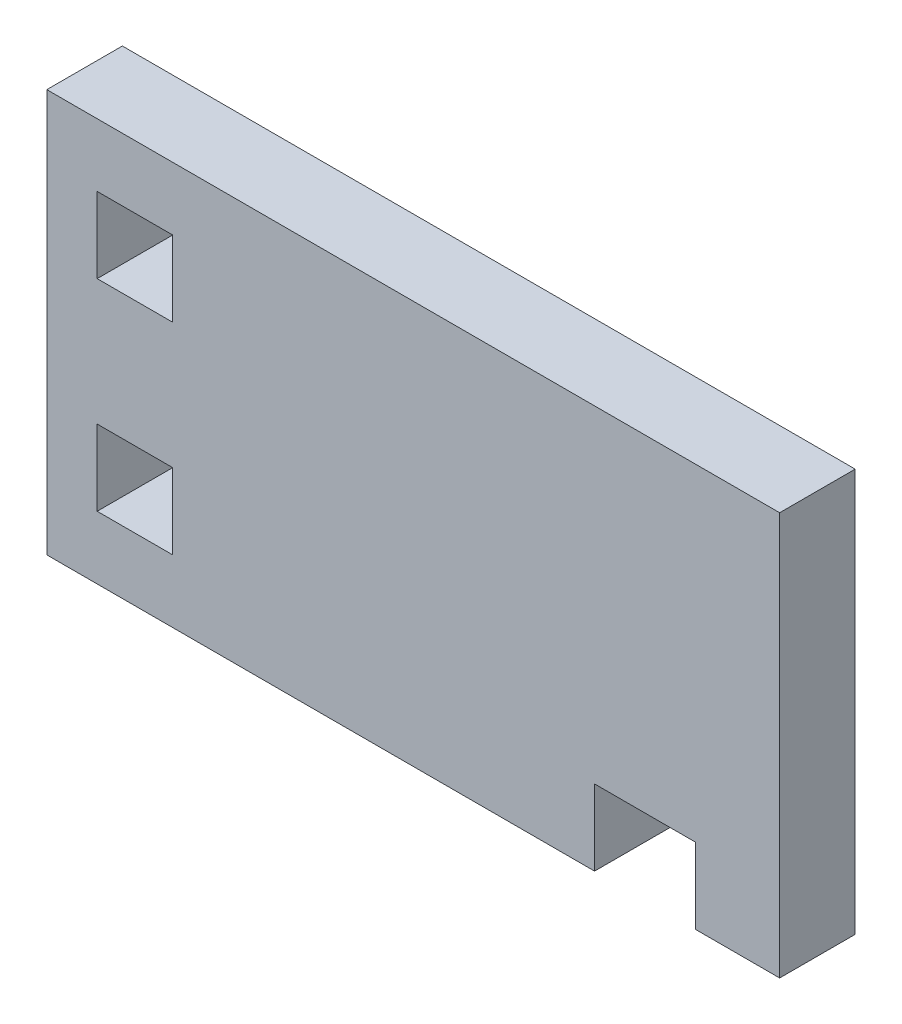
ISO-10303-21;
HEADER;
FILE_DESCRIPTION(('STEP AP214'),'2;1');
FILE_NAME('part.step','',(''),(''),'','','');
FILE_SCHEMA(('AUTOMOTIVE_DESIGN { 1 0 10303 214 1 1 1 1 }'));
ENDSEC;
DATA;
#1=APPLICATION_CONTEXT('core data for automotive mechanical design processes');
#2=APPLICATION_PROTOCOL_DEFINITION('international standard','automotive_design',2000,#1);
#3=PRODUCT_CONTEXT('',#1,'mechanical');
#4=PRODUCT('Part','Part','',(#3));
#5=PRODUCT_RELATED_PRODUCT_CATEGORY('part','',(#4));
#6=PRODUCT_DEFINITION_FORMATION('','',#4);
#7=PRODUCT_DEFINITION_CONTEXT('part definition',#1,'design');
#8=PRODUCT_DEFINITION('design','',#6,#7);
#9=PRODUCT_DEFINITION_SHAPE('','',#8);
#10=(LENGTH_UNIT() NAMED_UNIT(*) SI_UNIT(.MILLI.,.METRE.));
#11=(NAMED_UNIT(*) PLANE_ANGLE_UNIT() SI_UNIT($,.RADIAN.));
#12=(NAMED_UNIT(*) SI_UNIT($,.STERADIAN.) SOLID_ANGLE_UNIT());
#13=UNCERTAINTY_MEASURE_WITH_UNIT(LENGTH_MEASURE(1.E-05),#10,'distance_accuracy_value','');
#14=(GEOMETRIC_REPRESENTATION_CONTEXT(3) GLOBAL_UNCERTAINTY_ASSIGNED_CONTEXT((#13)) GLOBAL_UNIT_ASSIGNED_CONTEXT((#10,
#11,#12)) REPRESENTATION_CONTEXT('',''));
#15=CARTESIAN_POINT('',(0.,0.,0.));
#16=DIRECTION('',(0.,0.,1.));
#17=DIRECTION('',(1.,0.,0.));
#18=AXIS2_PLACEMENT_3D('',#15,#16,#17);
#19=CARTESIAN_POINT('',(0.,0.,15.));
#20=DIRECTION('',(0.,0.,-1.));
#21=DIRECTION('',(-1.,0.,0.));
#22=AXIS2_PLACEMENT_3D('',#19,#20,#21);
#23=PLANE('',#22);
#24=DIRECTION('',(0.,-1.,0.));
#25=VECTOR('',#24,1.);
#26=CARTESIAN_POINT('',(9.99999999999999,67.5,15.));
#27=LINE('',#26,#25);
#28=CARTESIAN_POINT('',(9.99999999999999,67.5,15.));
#29=VERTEX_POINT('',#28);
#30=CARTESIAN_POINT('',(10.,52.5,15.));
#31=VERTEX_POINT('',#30);
#32=EDGE_CURVE('E201',#29,#31,#27,.T.);
#33=ORIENTED_EDGE('',*,*,#32,.F.);
#34=DIRECTION('',(-1.,0.,0.));
#35=VECTOR('',#34,1.);
#36=CARTESIAN_POINT('',(9.99999999999999,67.5,15.));
#37=LINE('',#36,#35);
#38=CARTESIAN_POINT('',(25.,67.5,15.));
#39=VERTEX_POINT('',#38);
#40=EDGE_CURVE('E212',#39,#29,#37,.T.);
#41=ORIENTED_EDGE('',*,*,#40,.F.);
#42=DIRECTION('',(0.,1.,0.));
#43=VECTOR('',#42,1.);
#44=CARTESIAN_POINT('',(25.,67.5,15.));
#45=LINE('',#44,#43);
#46=CARTESIAN_POINT('',(25.,52.5,15.));
#47=VERTEX_POINT('',#46);
#48=EDGE_CURVE('E208',#47,#39,#45,.T.);
#49=ORIENTED_EDGE('',*,*,#48,.F.);
#50=DIRECTION('',(1.,0.,0.));
#51=VECTOR('',#50,1.);
#52=CARTESIAN_POINT('',(10.,52.5,15.));
#53=LINE('',#52,#51);
#54=EDGE_CURVE('E204',#31,#47,#53,.T.);
#55=ORIENTED_EDGE('',*,*,#54,.F.);
#56=EDGE_LOOP('',(#33,#41,#49,#55));
#57=FACE_BOUND('',#56,.T.);
#58=DIRECTION('',(1.,0.,0.));
#59=VECTOR('',#58,1.);
#60=CARTESIAN_POINT('',(108.75,0.,15.));
#61=LINE('',#60,#59);
#62=CARTESIAN_POINT('',(0.,0.,15.));
#63=VERTEX_POINT('',#62);
#64=CARTESIAN_POINT('',(108.75,0.,15.));
#65=VERTEX_POINT('',#64);
#66=EDGE_CURVE('E244',#63,#65,#61,.T.);
#67=ORIENTED_EDGE('',*,*,#66,.T.);
#68=DIRECTION('',(0.,1.,0.));
#69=VECTOR('',#68,1.);
#70=CARTESIAN_POINT('',(108.75,15.,15.));
#71=LINE('',#70,#69);
#72=CARTESIAN_POINT('',(108.75,15.,15.));
#73=VERTEX_POINT('',#72);
#74=EDGE_CURVE('E248',#65,#73,#71,.T.);
#75=ORIENTED_EDGE('',*,*,#74,.T.);
#76=DIRECTION('',(1.,0.,0.));
#77=VECTOR('',#76,1.);
#78=CARTESIAN_POINT('',(128.75,15.,15.));
#79=LINE('',#78,#77);
#80=CARTESIAN_POINT('',(128.75,15.,15.));
#81=VERTEX_POINT('',#80);
#82=EDGE_CURVE('E252',#73,#81,#79,.T.);
#83=ORIENTED_EDGE('',*,*,#82,.T.);
#84=DIRECTION('',(0.,-1.,0.));
#85=VECTOR('',#84,1.);
#86=CARTESIAN_POINT('',(128.75,0.,15.));
#87=LINE('',#86,#85);
#88=CARTESIAN_POINT('',(128.75,0.,15.));
#89=VERTEX_POINT('',#88);
#90=EDGE_CURVE('E255',#81,#89,#87,.T.);
#91=ORIENTED_EDGE('',*,*,#90,.T.);
#92=DIRECTION('',(1.,0.,0.));
#93=VECTOR('',#92,1.);
#94=CARTESIAN_POINT('',(145.5,0.,15.));
#95=LINE('',#94,#93);
#96=CARTESIAN_POINT('',(145.5,0.,15.));
#97=VERTEX_POINT('',#96);
#98=EDGE_CURVE('E258',#89,#97,#95,.T.);
#99=ORIENTED_EDGE('',*,*,#98,.T.);
#100=DIRECTION('',(0.,1.,0.));
#101=VECTOR('',#100,1.);
#102=CARTESIAN_POINT('',(145.5,80.,15.));
#103=LINE('',#102,#101);
#104=CARTESIAN_POINT('',(145.5,80.,15.));
#105=VERTEX_POINT('',#104);
#106=EDGE_CURVE('E261',#97,#105,#103,.T.);
#107=ORIENTED_EDGE('',*,*,#106,.T.);
#108=DIRECTION('',(-1.,0.,0.));
#109=VECTOR('',#108,1.);
#110=CARTESIAN_POINT('',(0.,80.,15.));
#111=LINE('',#110,#109);
#112=CARTESIAN_POINT('',(0.,80.,15.));
#113=VERTEX_POINT('',#112);
#114=EDGE_CURVE('E264',#105,#113,#111,.T.);
#115=ORIENTED_EDGE('',*,*,#114,.T.);
#116=DIRECTION('',(0.,-1.,0.));
#117=VECTOR('',#116,1.);
#118=CARTESIAN_POINT('',(0.,0.,15.));
#119=LINE('',#118,#117);
#120=EDGE_CURVE('E267',#113,#63,#119,.T.);
#121=ORIENTED_EDGE('',*,*,#120,.T.);
#122=EDGE_LOOP('',(#67,#75,#83,#91,#99,#107,#115,#121));
#123=FACE_BOUND('',#122,.T.);
#124=DIRECTION('',(0.,-1.,0.));
#125=VECTOR('',#124,1.);
#126=CARTESIAN_POINT('',(10.,27.5,15.));
#127=LINE('',#126,#125);
#128=CARTESIAN_POINT('',(10.,27.5,15.));
#129=VERTEX_POINT('',#128);
#130=CARTESIAN_POINT('',(10.,12.5,15.));
#131=VERTEX_POINT('',#130);
#132=EDGE_CURVE('E153',#129,#131,#127,.T.);
#133=ORIENTED_EDGE('',*,*,#132,.F.);
#134=DIRECTION('',(-1.,0.,0.));
#135=VECTOR('',#134,1.);
#136=CARTESIAN_POINT('',(10.,27.5,15.));
#137=LINE('',#136,#135);
#138=CARTESIAN_POINT('',(25.,27.5,15.));
#139=VERTEX_POINT('',#138);
#140=EDGE_CURVE('E179',#139,#129,#137,.T.);
#141=ORIENTED_EDGE('',*,*,#140,.F.);
#142=DIRECTION('',(0.,1.,0.));
#143=VECTOR('',#142,1.);
#144=CARTESIAN_POINT('',(25.,27.5,15.));
#145=LINE('',#144,#143);
#146=CARTESIAN_POINT('',(25.,12.5,15.));
#147=VERTEX_POINT('',#146);
#148=EDGE_CURVE('E175',#147,#139,#145,.T.);
#149=ORIENTED_EDGE('',*,*,#148,.F.);
#150=DIRECTION('',(1.,0.,0.));
#151=VECTOR('',#150,1.);
#152=CARTESIAN_POINT('',(10.,12.5,15.));
#153=LINE('',#152,#151);
#154=EDGE_CURVE('E162',#131,#147,#153,.T.);
#155=ORIENTED_EDGE('',*,*,#154,.F.);
#156=EDGE_LOOP('',(#133,#141,#149,#155));
#157=FACE_BOUND('',#156,.T.);
#158=ADVANCED_FACE('F39',(#57,#123,#157),#23,.F.);
#159=CARTESIAN_POINT('',(0.,0.,0.));
#160=DIRECTION('',(0.,0.,-1.));
#161=DIRECTION('',(-1.,0.,0.));
#162=AXIS2_PLACEMENT_3D('',#159,#160,#161);
#163=PLANE('',#162);
#164=DIRECTION('',(1.,0.,0.));
#165=VECTOR('',#164,1.);
#166=CARTESIAN_POINT('',(108.75,0.,0.));
#167=LINE('',#166,#165);
#168=CARTESIAN_POINT('',(0.,0.,0.));
#169=VERTEX_POINT('',#168);
#170=CARTESIAN_POINT('',(108.75,0.,0.));
#171=VERTEX_POINT('',#170);
#172=EDGE_CURVE('E243',#169,#171,#167,.T.);
#173=ORIENTED_EDGE('',*,*,#172,.F.);
#174=DIRECTION('',(0.,-1.,0.));
#175=VECTOR('',#174,1.);
#176=CARTESIAN_POINT('',(0.,0.,0.));
#177=LINE('',#176,#175);
#178=CARTESIAN_POINT('',(0.,80.,0.));
#179=VERTEX_POINT('',#178);
#180=EDGE_CURVE('E249',#179,#169,#177,.T.);
#181=ORIENTED_EDGE('',*,*,#180,.F.);
#182=DIRECTION('',(-1.,0.,0.));
#183=VECTOR('',#182,1.);
#184=CARTESIAN_POINT('',(0.,80.,0.));
#185=LINE('',#184,#183);
#186=CARTESIAN_POINT('',(145.5,80.,0.));
#187=VERTEX_POINT('',#186);
#188=EDGE_CURVE('E289',#187,#179,#185,.T.);
#189=ORIENTED_EDGE('',*,*,#188,.F.);
#190=DIRECTION('',(0.,1.,0.));
#191=VECTOR('',#190,1.);
#192=CARTESIAN_POINT('',(145.5,80.,0.));
#193=LINE('',#192,#191);
#194=CARTESIAN_POINT('',(145.5,0.,0.));
#195=VERTEX_POINT('',#194);
#196=EDGE_CURVE('E286',#195,#187,#193,.T.);
#197=ORIENTED_EDGE('',*,*,#196,.F.);
#198=DIRECTION('',(1.,0.,0.));
#199=VECTOR('',#198,1.);
#200=CARTESIAN_POINT('',(145.5,0.,0.));
#201=LINE('',#200,#199);
#202=CARTESIAN_POINT('',(128.75,0.,0.));
#203=VERTEX_POINT('',#202);
#204=EDGE_CURVE('E283',#203,#195,#201,.T.);
#205=ORIENTED_EDGE('',*,*,#204,.F.);
#206=DIRECTION('',(0.,-1.,0.));
#207=VECTOR('',#206,1.);
#208=CARTESIAN_POINT('',(128.75,0.,0.));
#209=LINE('',#208,#207);
#210=CARTESIAN_POINT('',(128.75,15.,0.));
#211=VERTEX_POINT('',#210);
#212=EDGE_CURVE('E280',#211,#203,#209,.T.);
#213=ORIENTED_EDGE('',*,*,#212,.F.);
#214=DIRECTION('',(1.,0.,0.));
#215=VECTOR('',#214,1.);
#216=CARTESIAN_POINT('',(128.75,15.,0.));
#217=LINE('',#216,#215);
#218=CARTESIAN_POINT('',(108.75,15.,0.));
#219=VERTEX_POINT('',#218);
#220=EDGE_CURVE('E277',#219,#211,#217,.T.);
#221=ORIENTED_EDGE('',*,*,#220,.F.);
#222=DIRECTION('',(0.,1.,0.));
#223=VECTOR('',#222,1.);
#224=CARTESIAN_POINT('',(108.75,15.,0.));
#225=LINE('',#224,#223);
#226=EDGE_CURVE('E274',#171,#219,#225,.T.);
#227=ORIENTED_EDGE('',*,*,#226,.F.);
#228=EDGE_LOOP('',(#173,#181,#189,#197,#205,#213,#221,#227));
#229=FACE_BOUND('',#228,.T.);
#230=DIRECTION('',(-1.,0.,0.));
#231=VECTOR('',#230,1.);
#232=CARTESIAN_POINT('',(9.99999999999999,67.5,0.));
#233=LINE('',#232,#231);
#234=CARTESIAN_POINT('',(25.,67.5,0.));
#235=VERTEX_POINT('',#234);
#236=CARTESIAN_POINT('',(9.99999999999999,67.5,0.));
#237=VERTEX_POINT('',#236);
#238=EDGE_CURVE('E205',#235,#237,#233,.T.);
#239=ORIENTED_EDGE('',*,*,#238,.T.);
#240=DIRECTION('',(0.,-1.,0.));
#241=VECTOR('',#240,1.);
#242=CARTESIAN_POINT('',(9.99999999999999,67.5,0.));
#243=LINE('',#242,#241);
#244=CARTESIAN_POINT('',(10.,52.5,0.));
#245=VERTEX_POINT('',#244);
#246=EDGE_CURVE('E171',#237,#245,#243,.T.);
#247=ORIENTED_EDGE('',*,*,#246,.T.);
#248=DIRECTION('',(1.,0.,0.));
#249=VECTOR('',#248,1.);
#250=CARTESIAN_POINT('',(10.,52.5,0.));
#251=LINE('',#250,#249);
#252=CARTESIAN_POINT('',(25.,52.5,0.));
#253=VERTEX_POINT('',#252);
#254=EDGE_CURVE('E219',#245,#253,#251,.T.);
#255=ORIENTED_EDGE('',*,*,#254,.T.);
#256=DIRECTION('',(0.,1.,0.));
#257=VECTOR('',#256,1.);
#258=CARTESIAN_POINT('',(25.,67.5,0.));
#259=LINE('',#258,#257);
#260=EDGE_CURVE('E223',#253,#235,#259,.T.);
#261=ORIENTED_EDGE('',*,*,#260,.T.);
#262=EDGE_LOOP('',(#239,#247,#255,#261));
#263=FACE_BOUND('',#262,.T.);
#264=DIRECTION('',(-1.,0.,0.));
#265=VECTOR('',#264,1.);
#266=CARTESIAN_POINT('',(10.,27.5,0.));
#267=LINE('',#266,#265);
#268=CARTESIAN_POINT('',(25.,27.5,0.));
#269=VERTEX_POINT('',#268);
#270=CARTESIAN_POINT('',(10.,27.5,0.));
#271=VERTEX_POINT('',#270);
#272=EDGE_CURVE('E163',#269,#271,#267,.T.);
#273=ORIENTED_EDGE('',*,*,#272,.T.);
#274=DIRECTION('',(0.,-1.,0.));
#275=VECTOR('',#274,1.);
#276=CARTESIAN_POINT('',(10.,27.5,0.));
#277=LINE('',#276,#275);
#278=CARTESIAN_POINT('',(10.,12.5,0.));
#279=VERTEX_POINT('',#278);
#280=EDGE_CURVE('E63',#271,#279,#277,.T.);
#281=ORIENTED_EDGE('',*,*,#280,.T.);
#282=DIRECTION('',(1.,0.,0.));
#283=VECTOR('',#282,1.);
#284=CARTESIAN_POINT('',(10.,12.5,0.));
#285=LINE('',#284,#283);
#286=CARTESIAN_POINT('',(25.,12.5,0.));
#287=VERTEX_POINT('',#286);
#288=EDGE_CURVE('E169',#279,#287,#285,.T.);
#289=ORIENTED_EDGE('',*,*,#288,.T.);
#290=DIRECTION('',(0.,1.,0.));
#291=VECTOR('',#290,1.);
#292=CARTESIAN_POINT('',(25.,27.5,0.));
#293=LINE('',#292,#291);
#294=EDGE_CURVE('E188',#287,#269,#293,.T.);
#295=ORIENTED_EDGE('',*,*,#294,.T.);
#296=EDGE_LOOP('',(#273,#281,#289,#295));
#297=FACE_BOUND('',#296,.T.);
#298=ADVANCED_FACE('F328',(#229,#263,#297),#163,.T.);
#299=CARTESIAN_POINT('',(108.75,0.,15.));
#300=DIRECTION('',(0.,1.,0.));
#301=DIRECTION('',(0.,0.,1.));
#302=AXIS2_PLACEMENT_3D('',#299,#300,#301);
#303=PLANE('',#302);
#304=ORIENTED_EDGE('',*,*,#172,.T.);
#305=DIRECTION('',(0.,0.,-1.));
#306=VECTOR('',#305,1.);
#307=CARTESIAN_POINT('',(108.75,0.,15.));
#308=LINE('',#307,#306);
#309=EDGE_CURVE('E11',#65,#171,#308,.T.);
#310=ORIENTED_EDGE('',*,*,#309,.F.);
#311=ORIENTED_EDGE('',*,*,#66,.F.);
#312=DIRECTION('',(0.,0.,-1.));
#313=VECTOR('',#312,1.);
#314=CARTESIAN_POINT('',(0.,0.,15.));
#315=LINE('',#314,#313);
#316=EDGE_CURVE('E270',#63,#169,#315,.T.);
#317=ORIENTED_EDGE('',*,*,#316,.T.);
#318=EDGE_LOOP('',(#304,#310,#311,#317));
#319=FACE_BOUND('',#318,.T.);
#320=ADVANCED_FACE('F41',(#319),#303,.F.);
#321=CARTESIAN_POINT('',(108.75,15.,15.));
#322=DIRECTION('',(-1.,0.,0.));
#323=DIRECTION('',(0.,0.,1.));
#324=AXIS2_PLACEMENT_3D('',#321,#322,#323);
#325=PLANE('',#324);
#326=ORIENTED_EDGE('',*,*,#226,.T.);
#327=DIRECTION('',(0.,0.,-1.));
#328=VECTOR('',#327,1.);
#329=CARTESIAN_POINT('',(108.75,15.,15.));
#330=LINE('',#329,#328);
#331=EDGE_CURVE('E48',#73,#219,#330,.T.);
#332=ORIENTED_EDGE('',*,*,#331,.F.);
#333=ORIENTED_EDGE('',*,*,#74,.F.);
#334=ORIENTED_EDGE('',*,*,#309,.T.);
#335=EDGE_LOOP('',(#326,#332,#333,#334));
#336=FACE_BOUND('',#335,.T.);
#337=ADVANCED_FACE('F345',(#336),#325,.F.);
#338=CARTESIAN_POINT('',(128.75,15.,15.));
#339=DIRECTION('',(0.,1.,0.));
#340=DIRECTION('',(-1.,0.,0.));
#341=AXIS2_PLACEMENT_3D('',#338,#339,#340);
#342=PLANE('',#341);
#343=ORIENTED_EDGE('',*,*,#220,.T.);
#344=DIRECTION('',(0.,0.,-1.));
#345=VECTOR('',#344,1.);
#346=CARTESIAN_POINT('',(128.75,15.,15.));
#347=LINE('',#346,#345);
#348=EDGE_CURVE('E313',#81,#211,#347,.T.);
#349=ORIENTED_EDGE('',*,*,#348,.F.);
#350=ORIENTED_EDGE('',*,*,#82,.F.);
#351=ORIENTED_EDGE('',*,*,#331,.T.);
#352=EDGE_LOOP('',(#343,#349,#350,#351));
#353=FACE_BOUND('',#352,.T.);
#354=ADVANCED_FACE('F322',(#353),#342,.F.);
#355=CARTESIAN_POINT('',(128.75,0.,15.));
#356=DIRECTION('',(1.,0.,0.));
#357=DIRECTION('',(0.,0.,-1.));
#358=AXIS2_PLACEMENT_3D('',#355,#356,#357);
#359=PLANE('',#358);
#360=ORIENTED_EDGE('',*,*,#212,.T.);
#361=DIRECTION('',(0.,0.,-1.));
#362=VECTOR('',#361,1.);
#363=CARTESIAN_POINT('',(128.75,0.,15.));
#364=LINE('',#363,#362);
#365=EDGE_CURVE('E309',#89,#203,#364,.T.);
#366=ORIENTED_EDGE('',*,*,#365,.F.);
#367=ORIENTED_EDGE('',*,*,#90,.F.);
#368=ORIENTED_EDGE('',*,*,#348,.T.);
#369=EDGE_LOOP('',(#360,#366,#367,#368));
#370=FACE_BOUND('',#369,.T.);
#371=ADVANCED_FACE('F334',(#370),#359,.F.);
#372=CARTESIAN_POINT('',(145.5,0.,15.));
#373=DIRECTION('',(0.,1.,0.));
#374=DIRECTION('',(-1.,0.,0.));
#375=AXIS2_PLACEMENT_3D('',#372,#373,#374);
#376=PLANE('',#375);
#377=ORIENTED_EDGE('',*,*,#204,.T.);
#378=DIRECTION('',(0.,0.,-1.));
#379=VECTOR('',#378,1.);
#380=CARTESIAN_POINT('',(145.5,0.,15.));
#381=LINE('',#380,#379);
#382=EDGE_CURVE('E305',#97,#195,#381,.T.);
#383=ORIENTED_EDGE('',*,*,#382,.F.);
#384=ORIENTED_EDGE('',*,*,#98,.F.);
#385=ORIENTED_EDGE('',*,*,#365,.T.);
#386=EDGE_LOOP('',(#377,#383,#384,#385));
#387=FACE_BOUND('',#386,.T.);
#388=ADVANCED_FACE('F338',(#387),#376,.F.);
#389=CARTESIAN_POINT('',(145.5,80.,15.));
#390=DIRECTION('',(-1.,0.,0.));
#391=DIRECTION('',(0.,0.,1.));
#392=AXIS2_PLACEMENT_3D('',#389,#390,#391);
#393=PLANE('',#392);
#394=ORIENTED_EDGE('',*,*,#196,.T.);
#395=DIRECTION('',(0.,0.,-1.));
#396=VECTOR('',#395,1.);
#397=CARTESIAN_POINT('',(145.5,80.,15.));
#398=LINE('',#397,#396);
#399=EDGE_CURVE('E301',#105,#187,#398,.T.);
#400=ORIENTED_EDGE('',*,*,#399,.F.);
#401=ORIENTED_EDGE('',*,*,#106,.F.);
#402=ORIENTED_EDGE('',*,*,#382,.T.);
#403=EDGE_LOOP('',(#394,#400,#401,#402));
#404=FACE_BOUND('',#403,.T.);
#405=ADVANCED_FACE('F358',(#404),#393,.F.);
#406=CARTESIAN_POINT('',(0.,80.,15.));
#407=DIRECTION('',(0.,-1.,0.));
#408=DIRECTION('',(0.,0.,-1.));
#409=AXIS2_PLACEMENT_3D('',#406,#407,#408);
#410=PLANE('',#409);
#411=ORIENTED_EDGE('',*,*,#188,.T.);
#412=DIRECTION('',(0.,0.,-1.));
#413=VECTOR('',#412,1.);
#414=CARTESIAN_POINT('',(0.,80.,15.));
#415=LINE('',#414,#413);
#416=EDGE_CURVE('E297',#113,#179,#415,.T.);
#417=ORIENTED_EDGE('',*,*,#416,.F.);
#418=ORIENTED_EDGE('',*,*,#114,.F.);
#419=ORIENTED_EDGE('',*,*,#399,.T.);
#420=EDGE_LOOP('',(#411,#417,#418,#419));
#421=FACE_BOUND('',#420,.T.);
#422=ADVANCED_FACE('F356',(#421),#410,.F.);
#423=CARTESIAN_POINT('',(0.,0.,15.));
#424=DIRECTION('',(1.,0.,0.));
#425=DIRECTION('',(0.,0.,-1.));
#426=AXIS2_PLACEMENT_3D('',#423,#424,#425);
#427=PLANE('',#426);
#428=ORIENTED_EDGE('',*,*,#180,.T.);
#429=ORIENTED_EDGE('',*,*,#316,.F.);
#430=ORIENTED_EDGE('',*,*,#120,.F.);
#431=ORIENTED_EDGE('',*,*,#416,.T.);
#432=EDGE_LOOP('',(#428,#429,#430,#431));
#433=FACE_BOUND('',#432,.T.);
#434=ADVANCED_FACE('F351',(#433),#427,.F.);
#435=CARTESIAN_POINT('',(9.99999999999999,67.5,15.));
#436=DIRECTION('',(1.,0.,0.));
#437=DIRECTION('',(0.,1.,0.));
#438=AXIS2_PLACEMENT_3D('',#435,#436,#437);
#439=PLANE('',#438);
#440=ORIENTED_EDGE('',*,*,#246,.F.);
#441=DIRECTION('',(0.,0.,-1.));
#442=VECTOR('',#441,1.);
#443=CARTESIAN_POINT('',(9.99999999999999,67.5,15.));
#444=LINE('',#443,#442);
#445=EDGE_CURVE('E215',#29,#237,#444,.T.);
#446=ORIENTED_EDGE('',*,*,#445,.F.);
#447=ORIENTED_EDGE('',*,*,#32,.T.);
#448=DIRECTION('',(0.,0.,-1.));
#449=VECTOR('',#448,1.);
#450=CARTESIAN_POINT('',(10.,52.5,15.));
#451=LINE('',#450,#449);
#452=EDGE_CURVE('E239',#31,#245,#451,.T.);
#453=ORIENTED_EDGE('',*,*,#452,.T.);
#454=EDGE_LOOP('',(#440,#446,#447,#453));
#455=FACE_BOUND('',#454,.T.);
#456=ADVANCED_FACE('F376',(#455),#439,.T.);
#457=CARTESIAN_POINT('',(10.,52.5,15.));
#458=DIRECTION('',(0.,1.,0.));
#459=DIRECTION('',(0.,0.,1.));
#460=AXIS2_PLACEMENT_3D('',#457,#458,#459);
#461=PLANE('',#460);
#462=ORIENTED_EDGE('',*,*,#254,.F.);
#463=ORIENTED_EDGE('',*,*,#452,.F.);
#464=ORIENTED_EDGE('',*,*,#54,.T.);
#465=DIRECTION('',(0.,0.,-1.));
#466=VECTOR('',#465,1.);
#467=CARTESIAN_POINT('',(25.,52.5,15.));
#468=LINE('',#467,#466);
#469=EDGE_CURVE('E236',#47,#253,#468,.T.);
#470=ORIENTED_EDGE('',*,*,#469,.T.);
#471=EDGE_LOOP('',(#462,#463,#464,#470));
#472=FACE_BOUND('',#471,.T.);
#473=ADVANCED_FACE('F383',(#472),#461,.T.);
#474=CARTESIAN_POINT('',(25.,67.5,15.));
#475=DIRECTION('',(-1.,0.,0.));
#476=DIRECTION('',(0.,-1.,0.));
#477=AXIS2_PLACEMENT_3D('',#474,#475,#476);
#478=PLANE('',#477);
#479=ORIENTED_EDGE('',*,*,#260,.F.);
#480=ORIENTED_EDGE('',*,*,#469,.F.);
#481=ORIENTED_EDGE('',*,*,#48,.T.);
#482=DIRECTION('',(0.,0.,-1.));
#483=VECTOR('',#482,1.);
#484=CARTESIAN_POINT('',(25.,67.5,15.));
#485=LINE('',#484,#483);
#486=EDGE_CURVE('E233',#39,#235,#485,.T.);
#487=ORIENTED_EDGE('',*,*,#486,.T.);
#488=EDGE_LOOP('',(#479,#480,#481,#487));
#489=FACE_BOUND('',#488,.T.);
#490=ADVANCED_FACE('F388',(#489),#478,.T.);
#491=CARTESIAN_POINT('',(9.99999999999999,67.5,15.));
#492=DIRECTION('',(0.,-1.,0.));
#493=DIRECTION('',(0.,0.,-1.));
#494=AXIS2_PLACEMENT_3D('',#491,#492,#493);
#495=PLANE('',#494);
#496=ORIENTED_EDGE('',*,*,#238,.F.);
#497=ORIENTED_EDGE('',*,*,#486,.F.);
#498=ORIENTED_EDGE('',*,*,#40,.T.);
#499=ORIENTED_EDGE('',*,*,#445,.T.);
#500=EDGE_LOOP('',(#496,#497,#498,#499));
#501=FACE_BOUND('',#500,.T.);
#502=ADVANCED_FACE('F394',(#501),#495,.T.);
#503=CARTESIAN_POINT('',(10.,27.5,15.));
#504=DIRECTION('',(1.,0.,0.));
#505=DIRECTION('',(0.,1.,0.));
#506=AXIS2_PLACEMENT_3D('',#503,#504,#505);
#507=PLANE('',#506);
#508=ORIENTED_EDGE('',*,*,#280,.F.);
#509=DIRECTION('',(0.,0.,-1.));
#510=VECTOR('',#509,1.);
#511=CARTESIAN_POINT('',(10.,27.5,15.));
#512=LINE('',#511,#510);
#513=EDGE_CURVE('E157',#129,#271,#512,.T.);
#514=ORIENTED_EDGE('',*,*,#513,.F.);
#515=ORIENTED_EDGE('',*,*,#132,.T.);
#516=DIRECTION('',(0.,0.,-1.));
#517=VECTOR('',#516,1.);
#518=CARTESIAN_POINT('',(10.,12.5,15.));
#519=LINE('',#518,#517);
#520=EDGE_CURVE('E156',#131,#279,#519,.T.);
#521=ORIENTED_EDGE('',*,*,#520,.T.);
#522=EDGE_LOOP('',(#508,#514,#515,#521));
#523=FACE_BOUND('',#522,.T.);
#524=ADVANCED_FACE('F155',(#523),#507,.T.);
#525=CARTESIAN_POINT('',(10.,12.5,15.));
#526=DIRECTION('',(0.,1.,0.));
#527=DIRECTION('',(-1.,0.,0.));
#528=AXIS2_PLACEMENT_3D('',#525,#526,#527);
#529=PLANE('',#528);
#530=ORIENTED_EDGE('',*,*,#288,.F.);
#531=ORIENTED_EDGE('',*,*,#520,.F.);
#532=ORIENTED_EDGE('',*,*,#154,.T.);
#533=DIRECTION('',(0.,0.,-1.));
#534=VECTOR('',#533,1.);
#535=CARTESIAN_POINT('',(25.,12.5,15.));
#536=LINE('',#535,#534);
#537=EDGE_CURVE('E172',#147,#287,#536,.T.);
#538=ORIENTED_EDGE('',*,*,#537,.T.);
#539=EDGE_LOOP('',(#530,#531,#532,#538));
#540=FACE_BOUND('',#539,.T.);
#541=ADVANCED_FACE('F166',(#540),#529,.T.);
#542=CARTESIAN_POINT('',(25.,27.5,15.));
#543=DIRECTION('',(-1.,0.,0.));
#544=DIRECTION('',(0.,-1.,0.));
#545=AXIS2_PLACEMENT_3D('',#542,#543,#544);
#546=PLANE('',#545);
#547=ORIENTED_EDGE('',*,*,#294,.F.);
#548=ORIENTED_EDGE('',*,*,#537,.F.);
#549=ORIENTED_EDGE('',*,*,#148,.T.);
#550=DIRECTION('',(0.,0.,-1.));
#551=VECTOR('',#550,1.);
#552=CARTESIAN_POINT('',(25.,27.5,15.));
#553=LINE('',#552,#551);
#554=EDGE_CURVE('E55',#139,#269,#553,.T.);
#555=ORIENTED_EDGE('',*,*,#554,.T.);
#556=EDGE_LOOP('',(#547,#548,#549,#555));
#557=FACE_BOUND('',#556,.T.);
#558=ADVANCED_FACE('F413',(#557),#546,.T.);
#559=CARTESIAN_POINT('',(10.,27.5,15.));
#560=DIRECTION('',(0.,-1.,0.));
#561=DIRECTION('',(0.,0.,-1.));
#562=AXIS2_PLACEMENT_3D('',#559,#560,#561);
#563=PLANE('',#562);
#564=ORIENTED_EDGE('',*,*,#272,.F.);
#565=ORIENTED_EDGE('',*,*,#554,.F.);
#566=ORIENTED_EDGE('',*,*,#140,.T.);
#567=ORIENTED_EDGE('',*,*,#513,.T.);
#568=EDGE_LOOP('',(#564,#565,#566,#567));
#569=FACE_BOUND('',#568,.T.);
#570=ADVANCED_FACE('F416',(#569),#563,.T.);
#571=CLOSED_SHELL('',(#158,#298,#320,#337,#354,#371,#388,#405,#422,#434,#456,#473,#490,#502,
#524,#541,#558,#570));
#572=MANIFOLD_SOLID_BREP('B2',#571);
#573=ADVANCED_BREP_SHAPE_REPRESENTATION('',(#18,#572),#14);
#574=SHAPE_DEFINITION_REPRESENTATION(#9,#573);
ENDSEC;
END-ISO-10303-21;
